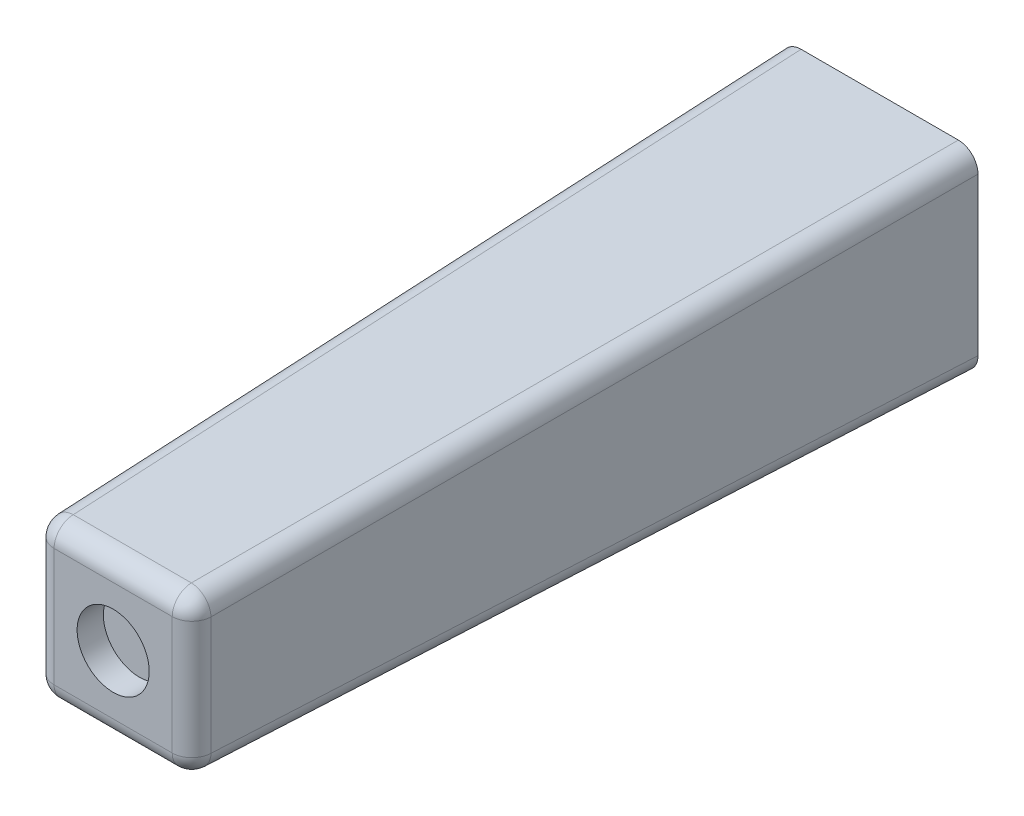
ISO-10303-21;
HEADER;
FILE_DESCRIPTION(('STEP AP214'),'2;1');
FILE_NAME('part.step','',(''),(''),'','','');
FILE_SCHEMA(('AUTOMOTIVE_DESIGN { 1 0 10303 214 1 1 1 1 }'));
ENDSEC;
DATA;
#1=APPLICATION_CONTEXT('core data for automotive mechanical design processes');
#2=APPLICATION_PROTOCOL_DEFINITION('international standard','automotive_design',2000,#1);
#3=PRODUCT_CONTEXT('',#1,'mechanical');
#4=PRODUCT('Part','Part','',(#3));
#5=PRODUCT_RELATED_PRODUCT_CATEGORY('part','',(#4));
#6=PRODUCT_DEFINITION_FORMATION('','',#4);
#7=PRODUCT_DEFINITION_CONTEXT('part definition',#1,'design');
#8=PRODUCT_DEFINITION('design','',#6,#7);
#9=PRODUCT_DEFINITION_SHAPE('','',#8);
#10=(LENGTH_UNIT() NAMED_UNIT(*) SI_UNIT(.MILLI.,.METRE.));
#11=(NAMED_UNIT(*) PLANE_ANGLE_UNIT() SI_UNIT($,.RADIAN.));
#12=(NAMED_UNIT(*) SI_UNIT($,.STERADIAN.) SOLID_ANGLE_UNIT());
#13=UNCERTAINTY_MEASURE_WITH_UNIT(LENGTH_MEASURE(1.E-05),#10,'distance_accuracy_value','');
#14=(GEOMETRIC_REPRESENTATION_CONTEXT(3) GLOBAL_UNCERTAINTY_ASSIGNED_CONTEXT((#13)) GLOBAL_UNIT_ASSIGNED_CONTEXT((#10,
#11,#12)) REPRESENTATION_CONTEXT('',''));
#15=CARTESIAN_POINT('',(0.,0.,0.));
#16=DIRECTION('',(0.,0.,1.));
#17=DIRECTION('',(1.,0.,0.));
#18=AXIS2_PLACEMENT_3D('',#15,#16,#17);
#19=CARTESIAN_POINT('',(7.5,-7.5,0.));
#20=DIRECTION('',(0.999657324975557,0.,0.0261769483078732));
#21=DIRECTION('',(0.0261769483078732,0.,-0.999657324975557));
#22=AXIS2_PLACEMENT_3D('',#19,#20,#21);
#23=PLANE('',#22);
#24=DIRECTION('',(0.,1.,0.));
#25=VECTOR('',#24,1.);
#26=CARTESIAN_POINT('',(7.5,-7.5,0.));
#27=LINE('',#26,#25);
#28=CARTESIAN_POINT('',(7.5,-6.00051401253666,0.));
#29=VERTEX_POINT('',#28);
#30=CARTESIAN_POINT('',(7.5,6.00051401253666,0.));
#31=VERTEX_POINT('',#30);
#32=EDGE_CURVE('E302',#29,#31,#27,.T.);
#33=ORIENTED_EDGE('',*,*,#32,.T.);
#34=DIRECTION('',(-0.0261679842649794,-0.0261679842649794,0.99931500198837));
#35=VECTOR('',#34,1.);
#36=CARTESIAN_POINT('',(7.49075534211638,5.99126935465305,0.353039241303446));
#37=LINE('',#36,#35);
#38=CARTESIAN_POINT('',(6.00637426928338,4.50688828182004,57.0392654224618));
#39=VERTEX_POINT('',#38);
#40=EDGE_CURVE('E169',#31,#39,#37,.T.);
#41=ORIENTED_EDGE('',*,*,#40,.T.);
#42=DIRECTION('',(0.,1.,0.));
#43=VECTOR('',#42,1.);
#44=CARTESIAN_POINT('',(6.00637426928338,-7.5,57.0392654224618));
#45=LINE('',#44,#43);
#46=CARTESIAN_POINT('',(6.00637426928338,-4.50688828182004,57.0392654224618));
#47=VERTEX_POINT('',#46);
#48=EDGE_CURVE('E167',#39,#47,#45,.F.);
#49=ORIENTED_EDGE('',*,*,#48,.T.);
#50=DIRECTION('',(-0.0261679842649794,0.0261679842649794,0.99931500198837));
#51=VECTOR('',#50,1.);
#52=CARTESIAN_POINT('',(7.50102679312377,-6.00154080566043,-0.0392116474133964));
#53=LINE('',#52,#51);
#54=EDGE_CURVE('E165',#47,#29,#53,.F.);
#55=ORIENTED_EDGE('',*,*,#54,.T.);
#56=EDGE_LOOP('',(#33,#41,#49,#55));
#57=FACE_BOUND('',#56,.T.);
#58=ADVANCED_FACE('F43',(#57),#23,.T.);
#59=CARTESIAN_POINT('',(-7.5,7.5,0.));
#60=DIRECTION('',(0.,0.999657324975557,0.0261769483078732));
#61=DIRECTION('',(0.,-0.0261769483078732,0.999657324975557));
#62=AXIS2_PLACEMENT_3D('',#59,#60,#61);
#63=PLANE('',#62);
#64=DIRECTION('',(-1.,0.,0.));
#65=VECTOR('',#64,1.);
#66=CARTESIAN_POINT('',(-7.5,6.00637426928338,57.0392654224618));
#67=LINE('',#66,#65);
#68=CARTESIAN_POINT('',(-4.50688828182004,6.00637426928338,57.0392654224618));
#69=VERTEX_POINT('',#68);
#70=CARTESIAN_POINT('',(4.50688828182004,6.00637426928338,57.0392654224618));
#71=VERTEX_POINT('',#70);
#72=EDGE_CURVE('E127',#69,#71,#67,.F.);
#73=ORIENTED_EDGE('',*,*,#72,.T.);
#74=DIRECTION('',(-0.0261679842649794,-0.0261679842649794,0.99931500198837));
#75=VECTOR('',#74,1.);
#76=CARTESIAN_POINT('',(5.99126935465305,7.49075534211638,0.353039241303446));
#77=LINE('',#76,#75);
#78=CARTESIAN_POINT('',(6.00051401253666,7.5,0.));
#79=VERTEX_POINT('',#78);
#80=EDGE_CURVE('E163',#71,#79,#77,.F.);
#81=ORIENTED_EDGE('',*,*,#80,.T.);
#82=DIRECTION('',(-1.,0.,0.));
#83=VECTOR('',#82,1.);
#84=CARTESIAN_POINT('',(-7.5,7.5,0.));
#85=LINE('',#84,#83);
#86=CARTESIAN_POINT('',(-6.00051401253666,7.5,0.));
#87=VERTEX_POINT('',#86);
#88=EDGE_CURVE('E307',#79,#87,#85,.T.);
#89=ORIENTED_EDGE('',*,*,#88,.T.);
#90=DIRECTION('',(0.0261679842649794,-0.0261679842649794,0.99931500198837));
#91=VECTOR('',#90,1.);
#92=CARTESIAN_POINT('',(-6.00154080566043,7.50102679312376,-0.0392116474133964));
#93=LINE('',#92,#91);
#94=EDGE_CURVE('E156',#87,#69,#93,.T.);
#95=ORIENTED_EDGE('',*,*,#94,.T.);
#96=EDGE_LOOP('',(#73,#81,#89,#95));
#97=FACE_BOUND('',#96,.T.);
#98=ADVANCED_FACE('F227',(#97),#63,.T.);
#99=CARTESIAN_POINT('',(-7.5,-7.5,0.));
#100=DIRECTION('',(-0.999657324975557,0.,0.0261769483078732));
#101=DIRECTION('',(0.0261769483078732,0.,0.999657324975557));
#102=AXIS2_PLACEMENT_3D('',#99,#100,#101);
#103=PLANE('',#102);
#104=DIRECTION('',(0.,-1.,0.));
#105=VECTOR('',#104,1.);
#106=CARTESIAN_POINT('',(-7.5,-7.5,0.));
#107=LINE('',#106,#105);
#108=CARTESIAN_POINT('',(-7.5,6.00051401253666,0.));
#109=VERTEX_POINT('',#108);
#110=CARTESIAN_POINT('',(-7.5,-6.00051401253666,0.));
#111=VERTEX_POINT('',#110);
#112=EDGE_CURVE('E305',#109,#111,#107,.T.);
#113=ORIENTED_EDGE('',*,*,#112,.T.);
#114=DIRECTION('',(0.0261679842649794,0.0261679842649794,0.99931500198837));
#115=VECTOR('',#114,1.);
#116=CARTESIAN_POINT('',(-7.50102679312377,-6.00154080566043,-0.0392116474133964));
#117=LINE('',#116,#115);
#118=CARTESIAN_POINT('',(-6.00637426928338,-4.50688828182004,57.0392654224618));
#119=VERTEX_POINT('',#118);
#120=EDGE_CURVE('E58',#111,#119,#117,.T.);
#121=ORIENTED_EDGE('',*,*,#120,.T.);
#122=DIRECTION('',(0.,-1.,0.));
#123=VECTOR('',#122,1.);
#124=CARTESIAN_POINT('',(-6.00637426928338,-7.5,57.0392654224618));
#125=LINE('',#124,#123);
#126=CARTESIAN_POINT('',(-6.00637426928337,4.50688828182004,57.0392654224618));
#127=VERTEX_POINT('',#126);
#128=EDGE_CURVE('E63',#119,#127,#125,.F.);
#129=ORIENTED_EDGE('',*,*,#128,.T.);
#130=DIRECTION('',(0.0261679842649794,-0.0261679842649794,0.99931500198837));
#131=VECTOR('',#130,1.);
#132=CARTESIAN_POINT('',(-7.49075534211638,5.99126935465305,0.353039241303446));
#133=LINE('',#132,#131);
#134=EDGE_CURVE('E177',#127,#109,#133,.F.);
#135=ORIENTED_EDGE('',*,*,#134,.T.);
#136=EDGE_LOOP('',(#113,#121,#129,#135));
#137=FACE_BOUND('',#136,.T.);
#138=ADVANCED_FACE('F234',(#137),#103,.T.);
#139=CARTESIAN_POINT('',(-7.5,-7.5,0.));
#140=DIRECTION('',(0.,-0.999657324975557,0.0261769483078732));
#141=DIRECTION('',(0.,-0.0261769483078732,-0.999657324975557));
#142=AXIS2_PLACEMENT_3D('',#139,#140,#141);
#143=PLANE('',#142);
#144=DIRECTION('',(1.,0.,0.));
#145=VECTOR('',#144,1.);
#146=CARTESIAN_POINT('',(-7.5,-6.00637426928338,57.0392654224618));
#147=LINE('',#146,#145);
#148=CARTESIAN_POINT('',(4.50688828182004,-6.00637426928338,57.0392654224618));
#149=VERTEX_POINT('',#148);
#150=CARTESIAN_POINT('',(-4.50688828182004,-6.00637426928338,57.0392654224618));
#151=VERTEX_POINT('',#150);
#152=EDGE_CURVE('E173',#149,#151,#147,.F.);
#153=ORIENTED_EDGE('',*,*,#152,.T.);
#154=DIRECTION('',(0.0261679842649794,0.0261679842649794,0.99931500198837));
#155=VECTOR('',#154,1.);
#156=CARTESIAN_POINT('',(-6.00154080566043,-7.50102679312377,-0.0392116474133964));
#157=LINE('',#156,#155);
#158=CARTESIAN_POINT('',(-6.00051401253666,-7.5,0.));
#159=VERTEX_POINT('',#158);
#160=EDGE_CURVE('E175',#151,#159,#157,.F.);
#161=ORIENTED_EDGE('',*,*,#160,.T.);
#162=DIRECTION('',(1.,0.,0.));
#163=VECTOR('',#162,1.);
#164=CARTESIAN_POINT('',(-7.5,-7.5,0.));
#165=LINE('',#164,#163);
#166=CARTESIAN_POINT('',(6.00051401253666,-7.5,0.));
#167=VERTEX_POINT('',#166);
#168=EDGE_CURVE('E149',#159,#167,#165,.T.);
#169=ORIENTED_EDGE('',*,*,#168,.T.);
#170=DIRECTION('',(-0.0261679842649794,0.0261679842649794,0.99931500198837));
#171=VECTOR('',#170,1.);
#172=CARTESIAN_POINT('',(5.99126935465305,-7.49075534211638,0.353039241303446));
#173=LINE('',#172,#171);
#174=EDGE_CURVE('E171',#167,#149,#173,.T.);
#175=ORIENTED_EDGE('',*,*,#174,.T.);
#176=EDGE_LOOP('',(#153,#161,#169,#175));
#177=FACE_BOUND('',#176,.T.);
#178=ADVANCED_FACE('F242',(#177),#143,.T.);
#179=CARTESIAN_POINT('',(0.,0.,58.5));
#180=DIRECTION('',(0.,0.,-1.));
#181=DIRECTION('',(-1.,0.,0.));
#182=AXIS2_PLACEMENT_3D('',#179,#180,#181);
#183=PLANE('',#182);
#184=DIRECTION('',(0.,-1.,0.));
#185=VECTOR('',#184,1.);
#186=CARTESIAN_POINT('',(4.50688828182004,0.,58.5));
#187=LINE('',#186,#185);
#188=CARTESIAN_POINT('',(4.50688828182004,-4.50688828182004,58.5));
#189=VERTEX_POINT('',#188);
#190=CARTESIAN_POINT('',(4.50688828182004,4.50688828182004,58.5));
#191=VERTEX_POINT('',#190);
#192=EDGE_CURVE('E154',#189,#191,#187,.F.);
#193=ORIENTED_EDGE('',*,*,#192,.T.);
#194=DIRECTION('',(1.,0.,0.));
#195=VECTOR('',#194,1.);
#196=CARTESIAN_POINT('',(0.,4.50688828182004,58.5));
#197=LINE('',#196,#195);
#198=CARTESIAN_POINT('',(-4.50688828182004,4.50688828182004,58.5));
#199=VERTEX_POINT('',#198);
#200=EDGE_CURVE('E125',#191,#199,#197,.F.);
#201=ORIENTED_EDGE('',*,*,#200,.T.);
#202=DIRECTION('',(0.,1.,0.));
#203=VECTOR('',#202,1.);
#204=CARTESIAN_POINT('',(-4.50688828182004,0.,58.5));
#205=LINE('',#204,#203);
#206=CARTESIAN_POINT('',(-4.50688828182004,-4.50688828182004,58.5));
#207=VERTEX_POINT('',#206);
#208=EDGE_CURVE('E142',#199,#207,#205,.F.);
#209=ORIENTED_EDGE('',*,*,#208,.T.);
#210=DIRECTION('',(-1.,0.,0.));
#211=VECTOR('',#210,1.);
#212=CARTESIAN_POINT('',(0.,-4.50688828182004,58.5));
#213=LINE('',#212,#211);
#214=EDGE_CURVE('E148',#207,#189,#213,.F.);
#215=ORIENTED_EDGE('',*,*,#214,.T.);
#216=EDGE_LOOP('',(#193,#201,#209,#215));
#217=FACE_BOUND('',#216,.T.);
#218=CARTESIAN_POINT('',(0.,0.,58.5));
#219=DIRECTION('',(0.,0.,1.));
#220=DIRECTION('',(1.,0.,0.));
#221=AXIS2_PLACEMENT_3D('',#218,#219,#220);
#222=CIRCLE('',#221,2.75);
#223=CARTESIAN_POINT('',(2.75,0.,58.5));
#224=VERTEX_POINT('',#223);
#225=EDGE_CURVE('E211',#224,#224,#222,.T.);
#226=ORIENTED_EDGE('',*,*,#225,.F.);
#227=EDGE_LOOP('',(#226));
#228=FACE_BOUND('',#227,.T.);
#229=ADVANCED_FACE('F151',(#217,#228),#183,.F.);
#230=CARTESIAN_POINT('',(0.,0.,0.));
#231=DIRECTION('',(0.,0.,-1.));
#232=DIRECTION('',(-1.,0.,0.));
#233=AXIS2_PLACEMENT_3D('',#230,#231,#232);
#234=PLANE('',#233);
#235=CARTESIAN_POINT('',(0.,0.,0.));
#236=DIRECTION('',(0.,0.,-1.));
#237=DIRECTION('',(-1.,0.,0.));
#238=AXIS2_PLACEMENT_3D('',#235,#236,#237);
#239=CIRCLE('',#238,2.);
#240=CARTESIAN_POINT('',(-2.,0.,0.));
#241=VERTEX_POINT('',#240);
#242=EDGE_CURVE('E11',#241,#241,#239,.F.);
#243=ORIENTED_EDGE('',*,*,#242,.T.);
#244=EDGE_LOOP('',(#243));
#245=FACE_BOUND('',#244,.T.);
#246=ORIENTED_EDGE('',*,*,#168,.F.);
#247=CARTESIAN_POINT('',(-5.9994858112637,-5.9994858112637,0.));
#248=DIRECTION('',(0.,0.,-1.));
#249=DIRECTION('',(-0.707106781186548,-0.707106781186548,0.));
#250=AXIS2_PLACEMENT_3D('',#247,#248,#249);
#251=ELLIPSE('',#250,1.50102820133331,1.5);
#252=EDGE_CURVE('E187',#159,#111,#251,.T.);
#253=ORIENTED_EDGE('',*,*,#252,.T.);
#254=ORIENTED_EDGE('',*,*,#112,.F.);
#255=CARTESIAN_POINT('',(-5.9994858112637,5.9994858112637,0.));
#256=DIRECTION('',(0.,0.,-1.));
#257=DIRECTION('',(-0.707106781186548,0.707106781186548,0.));
#258=AXIS2_PLACEMENT_3D('',#255,#256,#257);
#259=ELLIPSE('',#258,1.50102820133331,1.5);
#260=EDGE_CURVE('E183',#109,#87,#259,.T.);
#261=ORIENTED_EDGE('',*,*,#260,.T.);
#262=ORIENTED_EDGE('',*,*,#88,.F.);
#263=CARTESIAN_POINT('',(5.9994858112637,5.9994858112637,0.));
#264=DIRECTION('',(0.,0.,-1.));
#265=DIRECTION('',(0.707106781186548,0.707106781186548,0.));
#266=AXIS2_PLACEMENT_3D('',#263,#264,#265);
#267=ELLIPSE('',#266,1.50102820133331,1.5);
#268=EDGE_CURVE('E185',#79,#31,#267,.T.);
#269=ORIENTED_EDGE('',*,*,#268,.T.);
#270=ORIENTED_EDGE('',*,*,#32,.F.);
#271=CARTESIAN_POINT('',(5.9994858112637,-5.9994858112637,0.));
#272=DIRECTION('',(0.,0.,-1.));
#273=DIRECTION('',(0.707106781186547,-0.707106781186548,0.));
#274=AXIS2_PLACEMENT_3D('',#271,#272,#273);
#275=ELLIPSE('',#274,1.50102820133331,1.5);
#276=EDGE_CURVE('E181',#29,#167,#275,.T.);
#277=ORIENTED_EDGE('',*,*,#276,.T.);
#278=EDGE_LOOP('',(#246,#253,#254,#261,#262,#269,#270,#277));
#279=FACE_BOUND('',#278,.T.);
#280=ADVANCED_FACE('F240',(#245,#279),#234,.T.);
#281=CARTESIAN_POINT('',(0.,0.,10.));
#282=DIRECTION('',(0.,0.,-1.));
#283=DIRECTION('',(-1.,0.,0.));
#284=AXIS2_PLACEMENT_3D('',#281,#282,#283);
#285=CYLINDRICAL_SURFACE('',#284,1.5);
#286=CARTESIAN_POINT('',(0.,0.,0.5));
#287=DIRECTION('',(0.,0.,-1.));
#288=DIRECTION('',(-1.,0.,0.));
#289=AXIS2_PLACEMENT_3D('',#286,#287,#288);
#290=CIRCLE('',#289,1.5);
#291=CARTESIAN_POINT('',(-1.5,0.,0.5));
#292=VERTEX_POINT('',#291);
#293=EDGE_CURVE('E51',#292,#292,#290,.T.);
#294=ORIENTED_EDGE('',*,*,#293,.T.);
#295=EDGE_LOOP('',(#294));
#296=FACE_BOUND('',#295,.T.);
#297=CARTESIAN_POINT('',(0.,0.,10.));
#298=DIRECTION('',(0.,0.,-1.));
#299=DIRECTION('',(-1.,0.,0.));
#300=AXIS2_PLACEMENT_3D('',#297,#298,#299);
#301=CIRCLE('',#300,1.5);
#302=CARTESIAN_POINT('',(-1.5,0.,10.));
#303=VERTEX_POINT('',#302);
#304=EDGE_CURVE('E324',#303,#303,#301,.T.);
#305=ORIENTED_EDGE('',*,*,#304,.F.);
#306=EDGE_LOOP('',(#305));
#307=FACE_BOUND('',#306,.T.);
#308=ADVANCED_FACE('F215',(#296,#307),#285,.F.);
#309=CARTESIAN_POINT('',(0.,0.,10.));
#310=DIRECTION('',(0.,0.,-1.));
#311=DIRECTION('',(-1.,0.,0.));
#312=AXIS2_PLACEMENT_3D('',#309,#310,#311);
#313=PLANE('',#312);
#314=ORIENTED_EDGE('',*,*,#304,.T.);
#315=EDGE_LOOP('',(#314));
#316=FACE_BOUND('',#315,.T.);
#317=ADVANCED_FACE('F337',(#316),#313,.T.);
#318=CARTESIAN_POINT('',(0.,0.,56.5));
#319=DIRECTION('',(0.,0.,1.));
#320=DIRECTION('',(1.,0.,0.));
#321=AXIS2_PLACEMENT_3D('',#318,#319,#320);
#322=CYLINDRICAL_SURFACE('',#321,2.75);
#323=CARTESIAN_POINT('',(0.,0.,56.5));
#324=DIRECTION('',(0.,0.,1.));
#325=DIRECTION('',(1.,0.,0.));
#326=AXIS2_PLACEMENT_3D('',#323,#324,#325);
#327=CIRCLE('',#326,2.75);
#328=CARTESIAN_POINT('',(2.75,0.,56.5));
#329=VERTEX_POINT('',#328);
#330=EDGE_CURVE('E329',#329,#329,#327,.T.);
#331=ORIENTED_EDGE('',*,*,#330,.F.);
#332=EDGE_LOOP('',(#331));
#333=FACE_BOUND('',#332,.T.);
#334=ORIENTED_EDGE('',*,*,#225,.T.);
#335=EDGE_LOOP('',(#334));
#336=FACE_BOUND('',#335,.T.);
#337=ADVANCED_FACE('F290',(#333,#336),#322,.F.);
#338=CARTESIAN_POINT('',(0.,0.,56.5));
#339=DIRECTION('',(0.,0.,1.));
#340=DIRECTION('',(1.,0.,0.));
#341=AXIS2_PLACEMENT_3D('',#338,#339,#340);
#342=PLANE('',#341);
#343=ORIENTED_EDGE('',*,*,#330,.T.);
#344=EDGE_LOOP('',(#343));
#345=FACE_BOUND('',#344,.T.);
#346=ADVANCED_FACE('F285',(#345),#342,.T.);
#347=CARTESIAN_POINT('',(6.00154080566043,-6.00154080566043,-0.0784770698752062));
#348=DIRECTION('',(0.0261679842649794,-0.0261679842649794,-0.99931500198837));
#349=DIRECTION('',(0.,0.999657324975557,-0.0261769483078732));
#350=AXIS2_PLACEMENT_3D('',#347,#348,#349);
#351=CYLINDRICAL_SURFACE('',#350,1.5);
#352=ORIENTED_EDGE('',*,*,#276,.F.);
#353=ORIENTED_EDGE('',*,*,#54,.F.);
#354=CARTESIAN_POINT('',(4.50688828182004,-4.50688828182004,57.));
#355=DIRECTION('',(-0.026167984264981,0.026167984264981,0.99931500198837));
#356=DIRECTION('',(0.,-0.999657324975557,0.0261769483078748));
#357=AXIS2_PLACEMENT_3D('',#354,#355,#356);
#358=CIRCLE('',#357,1.5);
#359=EDGE_CURVE('E209',#149,#47,#358,.T.);
#360=ORIENTED_EDGE('',*,*,#359,.F.);
#361=ORIENTED_EDGE('',*,*,#174,.F.);
#362=EDGE_LOOP('',(#352,#353,#360,#361));
#363=FACE_BOUND('',#362,.T.);
#364=ADVANCED_FACE('F282',(#363),#351,.T.);
#365=CARTESIAN_POINT('',(0.,-4.50688828182004,57.));
#366=DIRECTION('',(-1.,0.,0.));
#367=DIRECTION('',(0.,0.,1.));
#368=AXIS2_PLACEMENT_3D('',#365,#366,#367);
#369=CYLINDRICAL_SURFACE('',#368,1.5);
#370=CARTESIAN_POINT('',(-4.50688828182004,-4.50688828182004,57.));
#371=DIRECTION('',(-1.,0.,0.));
#372=DIRECTION('',(0.,0.,1.));
#373=AXIS2_PLACEMENT_3D('',#370,#371,#372);
#374=CIRCLE('',#373,1.5);
#375=EDGE_CURVE('E203',#151,#207,#374,.T.);
#376=ORIENTED_EDGE('',*,*,#375,.F.);
#377=ORIENTED_EDGE('',*,*,#152,.F.);
#378=CARTESIAN_POINT('',(4.50688828182004,-4.50688828182004,57.));
#379=DIRECTION('',(1.,0.,0.));
#380=DIRECTION('',(0.,1.,0.));
#381=AXIS2_PLACEMENT_3D('',#378,#379,#380);
#382=CIRCLE('',#381,1.5);
#383=EDGE_CURVE('E206',#189,#149,#382,.T.);
#384=ORIENTED_EDGE('',*,*,#383,.F.);
#385=ORIENTED_EDGE('',*,*,#214,.F.);
#386=EDGE_LOOP('',(#376,#377,#384,#385));
#387=FACE_BOUND('',#386,.T.);
#388=ADVANCED_FACE('F279',(#387),#369,.T.);
#389=CARTESIAN_POINT('',(-6.00154080566043,-6.00154080566043,-0.0784770698752062));
#390=DIRECTION('',(-0.0261679842649794,-0.0261679842649794,-0.99931500198837));
#391=DIRECTION('',(-0.999657324975557,0.,0.0261769483078732));
#392=AXIS2_PLACEMENT_3D('',#389,#390,#391);
#393=CYLINDRICAL_SURFACE('',#392,1.5);
#394=ORIENTED_EDGE('',*,*,#252,.F.);
#395=ORIENTED_EDGE('',*,*,#160,.F.);
#396=CARTESIAN_POINT('',(-4.50688828182004,-4.50688828182004,57.));
#397=DIRECTION('',(0.026167984264981,0.026167984264981,0.99931500198837));
#398=DIRECTION('',(0.,-0.999657324975557,0.0261769483078748));
#399=AXIS2_PLACEMENT_3D('',#396,#397,#398);
#400=CIRCLE('',#399,1.5);
#401=EDGE_CURVE('E200',#119,#151,#400,.T.);
#402=ORIENTED_EDGE('',*,*,#401,.F.);
#403=ORIENTED_EDGE('',*,*,#120,.F.);
#404=EDGE_LOOP('',(#394,#395,#402,#403));
#405=FACE_BOUND('',#404,.T.);
#406=ADVANCED_FACE('F275',(#405),#393,.T.);
#407=CARTESIAN_POINT('',(4.50688828182004,-4.50688828182004,57.));
#408=DIRECTION('',(0.,0.,1.));
#409=DIRECTION('',(1.,0.,0.));
#410=AXIS2_PLACEMENT_3D('',#407,#408,#409);
#411=SPHERICAL_SURFACE('',#410,1.5);
#412=ORIENTED_EDGE('',*,*,#383,.T.);
#413=ORIENTED_EDGE('',*,*,#359,.T.);
#414=CARTESIAN_POINT('',(4.50688828182004,-4.50688828182004,57.));
#415=DIRECTION('',(0.,-1.,0.));
#416=DIRECTION('',(0.,0.,-1.));
#417=AXIS2_PLACEMENT_3D('',#414,#415,#416);
#418=CIRCLE('',#417,1.5);
#419=EDGE_CURVE('E197',#189,#47,#418,.F.);
#420=ORIENTED_EDGE('',*,*,#419,.F.);
#421=EDGE_LOOP('',(#412,#413,#420));
#422=FACE_BOUND('',#421,.T.);
#423=ADVANCED_FACE('F271',(#422),#411,.T.);
#424=CARTESIAN_POINT('',(-4.50688828182004,-4.50688828182004,57.));
#425=DIRECTION('',(0.,0.,1.));
#426=DIRECTION('',(1.,0.,0.));
#427=AXIS2_PLACEMENT_3D('',#424,#425,#426);
#428=SPHERICAL_SURFACE('',#427,1.5);
#429=ORIENTED_EDGE('',*,*,#401,.T.);
#430=ORIENTED_EDGE('',*,*,#375,.T.);
#431=CARTESIAN_POINT('',(-4.50688828182004,-4.50688828182004,57.));
#432=DIRECTION('',(0.,-1.,0.));
#433=DIRECTION('',(1.,0.,0.));
#434=AXIS2_PLACEMENT_3D('',#431,#432,#433);
#435=CIRCLE('',#434,1.5);
#436=EDGE_CURVE('E145',#119,#207,#435,.F.);
#437=ORIENTED_EDGE('',*,*,#436,.F.);
#438=EDGE_LOOP('',(#429,#430,#437));
#439=FACE_BOUND('',#438,.T.);
#440=ADVANCED_FACE('F267',(#439),#428,.T.);
#441=CARTESIAN_POINT('',(5.99126935465305,5.99126935465305,0.313773818841637));
#442=DIRECTION('',(0.0261679842649794,0.0261679842649794,-0.99931500198837));
#443=DIRECTION('',(-0.999657324975557,0.,-0.0261769483078732));
#444=AXIS2_PLACEMENT_3D('',#441,#442,#443);
#445=CYLINDRICAL_SURFACE('',#444,1.5);
#446=ORIENTED_EDGE('',*,*,#268,.F.);
#447=ORIENTED_EDGE('',*,*,#80,.F.);
#448=CARTESIAN_POINT('',(4.50688828182004,4.50688828182004,57.));
#449=DIRECTION('',(-0.026167984264981,-0.026167984264981,0.99931500198837));
#450=DIRECTION('',(0.999657324975557,0.,0.0261769483078748));
#451=AXIS2_PLACEMENT_3D('',#448,#449,#450);
#452=CIRCLE('',#451,1.5);
#453=EDGE_CURVE('E193',#39,#71,#452,.T.);
#454=ORIENTED_EDGE('',*,*,#453,.F.);
#455=ORIENTED_EDGE('',*,*,#40,.F.);
#456=EDGE_LOOP('',(#446,#447,#454,#455));
#457=FACE_BOUND('',#456,.T.);
#458=ADVANCED_FACE('F263',(#457),#445,.T.);
#459=CARTESIAN_POINT('',(4.50688828182004,0.,57.));
#460=DIRECTION('',(0.,-1.,0.));
#461=DIRECTION('',(1.,0.,0.));
#462=AXIS2_PLACEMENT_3D('',#459,#460,#461);
#463=CYLINDRICAL_SURFACE('',#462,1.5);
#464=ORIENTED_EDGE('',*,*,#419,.T.);
#465=ORIENTED_EDGE('',*,*,#48,.F.);
#466=CARTESIAN_POINT('',(4.50688828182004,4.50688828182004,57.));
#467=DIRECTION('',(0.,1.,0.));
#468=DIRECTION('',(-1.,0.,0.));
#469=AXIS2_PLACEMENT_3D('',#466,#467,#468);
#470=CIRCLE('',#469,1.5);
#471=EDGE_CURVE('E139',#191,#39,#470,.T.);
#472=ORIENTED_EDGE('',*,*,#471,.F.);
#473=ORIENTED_EDGE('',*,*,#192,.F.);
#474=EDGE_LOOP('',(#464,#465,#472,#473));
#475=FACE_BOUND('',#474,.T.);
#476=ADVANCED_FACE('F260',(#475),#463,.T.);
#477=CARTESIAN_POINT('',(-4.50688828182004,0.,57.));
#478=DIRECTION('',(0.,1.,0.));
#479=DIRECTION('',(-1.,0.,0.));
#480=AXIS2_PLACEMENT_3D('',#477,#478,#479);
#481=CYLINDRICAL_SURFACE('',#480,1.5);
#482=ORIENTED_EDGE('',*,*,#436,.T.);
#483=ORIENTED_EDGE('',*,*,#208,.F.);
#484=CARTESIAN_POINT('',(-4.50688828182004,4.50688828182004,57.));
#485=DIRECTION('',(0.,1.,0.));
#486=DIRECTION('',(0.,0.,1.));
#487=AXIS2_PLACEMENT_3D('',#484,#485,#486);
#488=CIRCLE('',#487,1.5);
#489=EDGE_CURVE('E133',#127,#199,#488,.T.);
#490=ORIENTED_EDGE('',*,*,#489,.F.);
#491=ORIENTED_EDGE('',*,*,#128,.F.);
#492=EDGE_LOOP('',(#482,#483,#490,#491));
#493=FACE_BOUND('',#492,.T.);
#494=ADVANCED_FACE('F143',(#493),#481,.T.);
#495=CARTESIAN_POINT('',(-5.99126935465305,5.99126935465305,0.313773818841636));
#496=DIRECTION('',(-0.0261679842649794,0.0261679842649794,-0.99931500198837));
#497=DIRECTION('',(-0.999657324975557,0.,0.0261769483078732));
#498=AXIS2_PLACEMENT_3D('',#495,#496,#497);
#499=CYLINDRICAL_SURFACE('',#498,1.5);
#500=ORIENTED_EDGE('',*,*,#260,.F.);
#501=ORIENTED_EDGE('',*,*,#134,.F.);
#502=CARTESIAN_POINT('',(-4.50688828182004,4.50688828182004,57.));
#503=DIRECTION('',(0.026167984264981,-0.026167984264981,0.99931500198837));
#504=DIRECTION('',(0.999657324975557,0.,-0.0261769483078748));
#505=AXIS2_PLACEMENT_3D('',#502,#503,#504);
#506=CIRCLE('',#505,1.5);
#507=EDGE_CURVE('E137',#69,#127,#506,.T.);
#508=ORIENTED_EDGE('',*,*,#507,.F.);
#509=ORIENTED_EDGE('',*,*,#94,.F.);
#510=EDGE_LOOP('',(#500,#501,#508,#509));
#511=FACE_BOUND('',#510,.T.);
#512=ADVANCED_FACE('F253',(#511),#499,.T.);
#513=CARTESIAN_POINT('',(4.50688828182004,4.50688828182004,57.));
#514=DIRECTION('',(0.,0.,1.));
#515=DIRECTION('',(1.,0.,0.));
#516=AXIS2_PLACEMENT_3D('',#513,#514,#515);
#517=SPHERICAL_SURFACE('',#516,1.5);
#518=ORIENTED_EDGE('',*,*,#471,.T.);
#519=ORIENTED_EDGE('',*,*,#453,.T.);
#520=CARTESIAN_POINT('',(4.50688828182004,4.50688828182004,57.));
#521=DIRECTION('',(1.,0.,0.));
#522=DIRECTION('',(0.,0.,-1.));
#523=AXIS2_PLACEMENT_3D('',#520,#521,#522);
#524=CIRCLE('',#523,1.5);
#525=EDGE_CURVE('E130',#191,#71,#524,.F.);
#526=ORIENTED_EDGE('',*,*,#525,.F.);
#527=EDGE_LOOP('',(#518,#519,#526));
#528=FACE_BOUND('',#527,.T.);
#529=ADVANCED_FACE('F250',(#528),#517,.T.);
#530=CARTESIAN_POINT('',(-4.50688828182004,4.50688828182004,57.));
#531=DIRECTION('',(0.,0.,1.));
#532=DIRECTION('',(1.,0.,0.));
#533=AXIS2_PLACEMENT_3D('',#530,#531,#532);
#534=SPHERICAL_SURFACE('',#533,1.5);
#535=ORIENTED_EDGE('',*,*,#507,.T.);
#536=ORIENTED_EDGE('',*,*,#489,.T.);
#537=CARTESIAN_POINT('',(-4.50688828182004,4.50688828182004,57.));
#538=DIRECTION('',(-1.,0.,0.));
#539=DIRECTION('',(0.,-1.,0.));
#540=AXIS2_PLACEMENT_3D('',#537,#538,#539);
#541=CIRCLE('',#540,1.5);
#542=EDGE_CURVE('E121',#69,#199,#541,.F.);
#543=ORIENTED_EDGE('',*,*,#542,.F.);
#544=EDGE_LOOP('',(#535,#536,#543));
#545=FACE_BOUND('',#544,.T.);
#546=ADVANCED_FACE('F135',(#545),#534,.T.);
#547=CARTESIAN_POINT('',(0.,4.50688828182004,57.));
#548=DIRECTION('',(1.,0.,0.));
#549=DIRECTION('',(0.,1.,0.));
#550=AXIS2_PLACEMENT_3D('',#547,#548,#549);
#551=CYLINDRICAL_SURFACE('',#550,1.5);
#552=ORIENTED_EDGE('',*,*,#525,.T.);
#553=ORIENTED_EDGE('',*,*,#72,.F.);
#554=ORIENTED_EDGE('',*,*,#542,.T.);
#555=ORIENTED_EDGE('',*,*,#200,.F.);
#556=EDGE_LOOP('',(#552,#553,#554,#555));
#557=FACE_BOUND('',#556,.T.);
#558=ADVANCED_FACE('F123',(#557),#551,.T.);
#559=CARTESIAN_POINT('',(0.,0.,0.5));
#560=DIRECTION('',(0.,0.,-1.));
#561=DIRECTION('',(-1.,0.,0.));
#562=AXIS2_PLACEMENT_3D('',#559,#560,#561);
#563=TOROIDAL_SURFACE('',#562,2.,0.5);
#564=ORIENTED_EDGE('',*,*,#242,.F.);
#565=EDGE_LOOP('',(#564));
#566=FACE_BOUND('',#565,.T.);
#567=ORIENTED_EDGE('',*,*,#293,.F.);
#568=EDGE_LOOP('',(#567));
#569=FACE_BOUND('',#568,.T.);
#570=ADVANCED_FACE('F45',(#566,#569),#563,.T.);
#571=CLOSED_SHELL('',(#58,#98,#138,#178,#229,#280,#308,#317,#337,#346,#364,#388,#406,#423,#440,
#458,#476,#494,#512,#529,#546,#558,#570));
#572=MANIFOLD_SOLID_BREP('B2',#571);
#573=ADVANCED_BREP_SHAPE_REPRESENTATION('',(#18,#572),#14);
#574=SHAPE_DEFINITION_REPRESENTATION(#9,#573);
ENDSEC;
END-ISO-10303-21;
